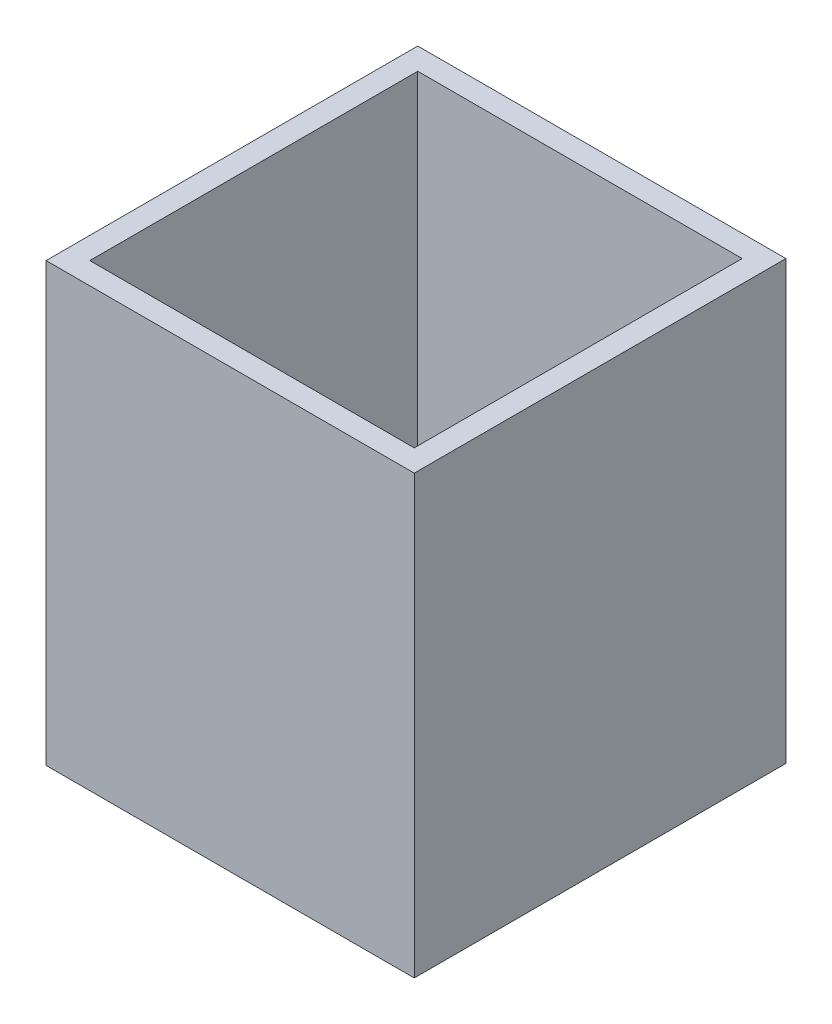
ISO-10303-21;
HEADER;
FILE_DESCRIPTION(('STEP AP214'),'2;1');
FILE_NAME('part.step','',(''),(''),'','','');
FILE_SCHEMA(('AUTOMOTIVE_DESIGN { 1 0 10303 214 1 1 1 1 }'));
ENDSEC;
DATA;
#1=APPLICATION_CONTEXT('core data for automotive mechanical design processes');
#2=APPLICATION_PROTOCOL_DEFINITION('international standard','automotive_design',2000,#1);
#3=PRODUCT_CONTEXT('',#1,'mechanical');
#4=PRODUCT('Part','Part','',(#3));
#5=PRODUCT_RELATED_PRODUCT_CATEGORY('part','',(#4));
#6=PRODUCT_DEFINITION_FORMATION('','',#4);
#7=PRODUCT_DEFINITION_CONTEXT('part definition',#1,'design');
#8=PRODUCT_DEFINITION('design','',#6,#7);
#9=PRODUCT_DEFINITION_SHAPE('','',#8);
#10=(LENGTH_UNIT() NAMED_UNIT(*) SI_UNIT(.MILLI.,.METRE.));
#11=(NAMED_UNIT(*) PLANE_ANGLE_UNIT() SI_UNIT($,.RADIAN.));
#12=(NAMED_UNIT(*) SI_UNIT($,.STERADIAN.) SOLID_ANGLE_UNIT());
#13=UNCERTAINTY_MEASURE_WITH_UNIT(LENGTH_MEASURE(1.E-05),#10,'distance_accuracy_value','');
#14=(GEOMETRIC_REPRESENTATION_CONTEXT(3) GLOBAL_UNCERTAINTY_ASSIGNED_CONTEXT((#13)) GLOBAL_UNIT_ASSIGNED_CONTEXT((#10,
#11,#12)) REPRESENTATION_CONTEXT('',''));
#15=CARTESIAN_POINT('',(0.,0.,0.));
#16=DIRECTION('',(0.,0.,1.));
#17=DIRECTION('',(1.,0.,0.));
#18=AXIS2_PLACEMENT_3D('',#15,#16,#17);
#19=CARTESIAN_POINT('',(0.,127.,0.));
#20=DIRECTION('',(0.,-1.,0.));
#21=DIRECTION('',(0.,0.,-1.));
#22=AXIS2_PLACEMENT_3D('',#19,#20,#21);
#23=PLANE('',#22);
#24=DIRECTION('',(0.,0.,-1.));
#25=VECTOR('',#24,1.);
#26=CARTESIAN_POINT('',(53.467,127.,53.975));
#27=LINE('',#26,#25);
#28=CARTESIAN_POINT('',(53.467,127.,53.975));
#29=VERTEX_POINT('',#28);
#30=CARTESIAN_POINT('',(53.467,127.,-53.975));
#31=VERTEX_POINT('',#30);
#32=EDGE_CURVE('E130',#29,#31,#27,.T.);
#33=ORIENTED_EDGE('',*,*,#32,.T.);
#34=DIRECTION('',(-1.,0.,0.));
#35=VECTOR('',#34,1.);
#36=CARTESIAN_POINT('',(-53.467,127.,-53.975));
#37=LINE('',#36,#35);
#38=CARTESIAN_POINT('',(-53.467,127.,-53.975));
#39=VERTEX_POINT('',#38);
#40=EDGE_CURVE('E133',#31,#39,#37,.T.);
#41=ORIENTED_EDGE('',*,*,#40,.T.);
#42=DIRECTION('',(0.,0.,1.));
#43=VECTOR('',#42,1.);
#44=CARTESIAN_POINT('',(-53.467,127.,53.975));
#45=LINE('',#44,#43);
#46=CARTESIAN_POINT('',(-53.467,127.,53.975));
#47=VERTEX_POINT('',#46);
#48=EDGE_CURVE('E136',#39,#47,#45,.T.);
#49=ORIENTED_EDGE('',*,*,#48,.T.);
#50=DIRECTION('',(1.,0.,0.));
#51=VECTOR('',#50,1.);
#52=CARTESIAN_POINT('',(-53.467,127.,53.975));
#53=LINE('',#52,#51);
#54=EDGE_CURVE('E138',#47,#29,#53,.T.);
#55=ORIENTED_EDGE('',*,*,#54,.T.);
#56=EDGE_LOOP('',(#33,#41,#49,#55));
#57=FACE_BOUND('',#56,.T.);
#58=DIRECTION('',(0.,0.,-1.));
#59=VECTOR('',#58,1.);
#60=CARTESIAN_POINT('',(47.117,127.,0.));
#61=LINE('',#60,#59);
#62=CARTESIAN_POINT('',(47.117,127.,47.625));
#63=VERTEX_POINT('',#62);
#64=CARTESIAN_POINT('',(47.117,127.,-47.625));
#65=VERTEX_POINT('',#64);
#66=EDGE_CURVE('E118',#63,#65,#61,.T.);
#67=ORIENTED_EDGE('',*,*,#66,.F.);
#68=DIRECTION('',(1.,0.,0.));
#69=VECTOR('',#68,1.);
#70=CARTESIAN_POINT('',(0.,127.,47.625));
#71=LINE('',#70,#69);
#72=CARTESIAN_POINT('',(-47.117,127.,47.625));
#73=VERTEX_POINT('',#72);
#74=EDGE_CURVE('E103',#73,#63,#71,.T.);
#75=ORIENTED_EDGE('',*,*,#74,.F.);
#76=DIRECTION('',(0.,0.,1.));
#77=VECTOR('',#76,1.);
#78=CARTESIAN_POINT('',(-47.117,127.,0.));
#79=LINE('',#78,#77);
#80=CARTESIAN_POINT('',(-47.117,127.,-47.625));
#81=VERTEX_POINT('',#80);
#82=EDGE_CURVE('E127',#81,#73,#79,.T.);
#83=ORIENTED_EDGE('',*,*,#82,.F.);
#84=DIRECTION('',(-1.,0.,0.));
#85=VECTOR('',#84,1.);
#86=CARTESIAN_POINT('',(0.,127.,-47.625));
#87=LINE('',#86,#85);
#88=EDGE_CURVE('E120',#65,#81,#87,.T.);
#89=ORIENTED_EDGE('',*,*,#88,.F.);
#90=EDGE_LOOP('',(#67,#75,#83,#89));
#91=FACE_BOUND('',#90,.T.);
#92=ADVANCED_FACE('F33',(#57,#91),#23,.F.);
#93=CARTESIAN_POINT('',(0.,0.,0.));
#94=DIRECTION('',(0.,-1.,0.));
#95=DIRECTION('',(0.,0.,-1.));
#96=AXIS2_PLACEMENT_3D('',#93,#94,#95);
#97=PLANE('',#96);
#98=DIRECTION('',(0.,0.,-1.));
#99=VECTOR('',#98,1.);
#100=CARTESIAN_POINT('',(53.467,0.,53.975));
#101=LINE('',#100,#99);
#102=CARTESIAN_POINT('',(53.467,0.,53.975));
#103=VERTEX_POINT('',#102);
#104=CARTESIAN_POINT('',(53.467,0.,-53.975));
#105=VERTEX_POINT('',#104);
#106=EDGE_CURVE('E141',#103,#105,#101,.T.);
#107=ORIENTED_EDGE('',*,*,#106,.F.);
#108=DIRECTION('',(1.,0.,0.));
#109=VECTOR('',#108,1.);
#110=CARTESIAN_POINT('',(-53.467,0.,53.975));
#111=LINE('',#110,#109);
#112=CARTESIAN_POINT('',(-53.467,0.,53.975));
#113=VERTEX_POINT('',#112);
#114=EDGE_CURVE('E134',#113,#103,#111,.T.);
#115=ORIENTED_EDGE('',*,*,#114,.F.);
#116=DIRECTION('',(0.,0.,1.));
#117=VECTOR('',#116,1.);
#118=CARTESIAN_POINT('',(-53.467,0.,53.975));
#119=LINE('',#118,#117);
#120=CARTESIAN_POINT('',(-53.467,0.,-53.975));
#121=VERTEX_POINT('',#120);
#122=EDGE_CURVE('E146',#121,#113,#119,.T.);
#123=ORIENTED_EDGE('',*,*,#122,.F.);
#124=DIRECTION('',(-1.,0.,0.));
#125=VECTOR('',#124,1.);
#126=CARTESIAN_POINT('',(-53.467,0.,-53.975));
#127=LINE('',#126,#125);
#128=EDGE_CURVE('E144',#105,#121,#127,.T.);
#129=ORIENTED_EDGE('',*,*,#128,.F.);
#130=EDGE_LOOP('',(#107,#115,#123,#129));
#131=FACE_BOUND('',#130,.T.);
#132=DIRECTION('',(1.,0.,0.));
#133=VECTOR('',#132,1.);
#134=CARTESIAN_POINT('',(0.,0.,47.625));
#135=LINE('',#134,#133);
#136=CARTESIAN_POINT('',(-47.117,0.,47.625));
#137=VERTEX_POINT('',#136);
#138=CARTESIAN_POINT('',(47.117,0.,47.625));
#139=VERTEX_POINT('',#138);
#140=EDGE_CURVE('E101',#137,#139,#135,.T.);
#141=ORIENTED_EDGE('',*,*,#140,.T.);
#142=DIRECTION('',(0.,0.,-1.));
#143=VECTOR('',#142,1.);
#144=CARTESIAN_POINT('',(47.117,0.,0.));
#145=LINE('',#144,#143);
#146=CARTESIAN_POINT('',(47.117,0.,-47.625));
#147=VERTEX_POINT('',#146);
#148=EDGE_CURVE('E109',#139,#147,#145,.T.);
#149=ORIENTED_EDGE('',*,*,#148,.T.);
#150=DIRECTION('',(-1.,0.,0.));
#151=VECTOR('',#150,1.);
#152=CARTESIAN_POINT('',(0.,0.,-47.625));
#153=LINE('',#152,#151);
#154=CARTESIAN_POINT('',(-47.117,0.,-47.625));
#155=VERTEX_POINT('',#154);
#156=EDGE_CURVE('E115',#147,#155,#153,.T.);
#157=ORIENTED_EDGE('',*,*,#156,.T.);
#158=DIRECTION('',(0.,0.,1.));
#159=VECTOR('',#158,1.);
#160=CARTESIAN_POINT('',(-47.117,0.,0.));
#161=LINE('',#160,#159);
#162=EDGE_CURVE('E55',#155,#137,#161,.T.);
#163=ORIENTED_EDGE('',*,*,#162,.T.);
#164=EDGE_LOOP('',(#141,#149,#157,#163));
#165=FACE_BOUND('',#164,.T.);
#166=ADVANCED_FACE('F117',(#131,#165),#97,.T.);
#167=CARTESIAN_POINT('',(53.467,127.,53.975));
#168=DIRECTION('',(-1.,0.,0.));
#169=DIRECTION('',(0.,0.,1.));
#170=AXIS2_PLACEMENT_3D('',#167,#168,#169);
#171=PLANE('',#170);
#172=ORIENTED_EDGE('',*,*,#106,.T.);
#173=DIRECTION('',(0.,-1.,0.));
#174=VECTOR('',#173,1.);
#175=CARTESIAN_POINT('',(53.467,127.,-53.975));
#176=LINE('',#175,#174);
#177=EDGE_CURVE('E11',#31,#105,#176,.T.);
#178=ORIENTED_EDGE('',*,*,#177,.F.);
#179=ORIENTED_EDGE('',*,*,#32,.F.);
#180=DIRECTION('',(0.,-1.,0.));
#181=VECTOR('',#180,1.);
#182=CARTESIAN_POINT('',(53.467,127.,53.975));
#183=LINE('',#182,#181);
#184=EDGE_CURVE('E140',#29,#103,#183,.T.);
#185=ORIENTED_EDGE('',*,*,#184,.T.);
#186=EDGE_LOOP('',(#172,#178,#179,#185));
#187=FACE_BOUND('',#186,.T.);
#188=ADVANCED_FACE('F35',(#187),#171,.F.);
#189=CARTESIAN_POINT('',(-53.467,127.,-53.975));
#190=DIRECTION('',(0.,0.,1.));
#191=DIRECTION('',(1.,0.,0.));
#192=AXIS2_PLACEMENT_3D('',#189,#190,#191);
#193=PLANE('',#192);
#194=ORIENTED_EDGE('',*,*,#128,.T.);
#195=DIRECTION('',(0.,-1.,0.));
#196=VECTOR('',#195,1.);
#197=CARTESIAN_POINT('',(-53.467,127.,-53.975));
#198=LINE('',#197,#196);
#199=EDGE_CURVE('E41',#39,#121,#198,.T.);
#200=ORIENTED_EDGE('',*,*,#199,.F.);
#201=ORIENTED_EDGE('',*,*,#40,.F.);
#202=ORIENTED_EDGE('',*,*,#177,.T.);
#203=EDGE_LOOP('',(#194,#200,#201,#202));
#204=FACE_BOUND('',#203,.T.);
#205=ADVANCED_FACE('F173',(#204),#193,.F.);
#206=CARTESIAN_POINT('',(-53.467,127.,53.975));
#207=DIRECTION('',(1.,0.,0.));
#208=DIRECTION('',(0.,0.,-1.));
#209=AXIS2_PLACEMENT_3D('',#206,#207,#208);
#210=PLANE('',#209);
#211=ORIENTED_EDGE('',*,*,#122,.T.);
#212=DIRECTION('',(0.,-1.,0.));
#213=VECTOR('',#212,1.);
#214=CARTESIAN_POINT('',(-53.467,127.,53.975));
#215=LINE('',#214,#213);
#216=EDGE_CURVE('E151',#47,#113,#215,.T.);
#217=ORIENTED_EDGE('',*,*,#216,.F.);
#218=ORIENTED_EDGE('',*,*,#48,.F.);
#219=ORIENTED_EDGE('',*,*,#199,.T.);
#220=EDGE_LOOP('',(#211,#217,#218,#219));
#221=FACE_BOUND('',#220,.T.);
#222=ADVANCED_FACE('F158',(#221),#210,.F.);
#223=CARTESIAN_POINT('',(-53.467,127.,53.975));
#224=DIRECTION('',(0.,0.,-1.));
#225=DIRECTION('',(-1.,0.,0.));
#226=AXIS2_PLACEMENT_3D('',#223,#224,#225);
#227=PLANE('',#226);
#228=ORIENTED_EDGE('',*,*,#114,.T.);
#229=ORIENTED_EDGE('',*,*,#184,.F.);
#230=ORIENTED_EDGE('',*,*,#54,.F.);
#231=ORIENTED_EDGE('',*,*,#216,.T.);
#232=EDGE_LOOP('',(#228,#229,#230,#231));
#233=FACE_BOUND('',#232,.T.);
#234=ADVANCED_FACE('F166',(#233),#227,.F.);
#235=CARTESIAN_POINT('',(47.117,127.,53.975));
#236=DIRECTION('',(-1.,0.,0.));
#237=DIRECTION('',(0.,0.,1.));
#238=AXIS2_PLACEMENT_3D('',#235,#236,#237);
#239=PLANE('',#238);
#240=ORIENTED_EDGE('',*,*,#148,.F.);
#241=DIRECTION('',(0.,-1.,0.));
#242=VECTOR('',#241,1.);
#243=CARTESIAN_POINT('',(47.117,127.,47.625));
#244=LINE('',#243,#242);
#245=EDGE_CURVE('E97',#63,#139,#244,.T.);
#246=ORIENTED_EDGE('',*,*,#245,.F.);
#247=ORIENTED_EDGE('',*,*,#66,.T.);
#248=DIRECTION('',(0.,-1.,0.));
#249=VECTOR('',#248,1.);
#250=CARTESIAN_POINT('',(47.117,127.,-47.625));
#251=LINE('',#250,#249);
#252=EDGE_CURVE('E112',#65,#147,#251,.T.);
#253=ORIENTED_EDGE('',*,*,#252,.T.);
#254=EDGE_LOOP('',(#240,#246,#247,#253));
#255=FACE_BOUND('',#254,.T.);
#256=ADVANCED_FACE('F110',(#255),#239,.T.);
#257=CARTESIAN_POINT('',(-53.467,127.,-47.625));
#258=DIRECTION('',(0.,0.,1.));
#259=DIRECTION('',(1.,0.,0.));
#260=AXIS2_PLACEMENT_3D('',#257,#258,#259);
#261=PLANE('',#260);
#262=ORIENTED_EDGE('',*,*,#156,.F.);
#263=ORIENTED_EDGE('',*,*,#252,.F.);
#264=ORIENTED_EDGE('',*,*,#88,.T.);
#265=DIRECTION('',(0.,-1.,0.));
#266=VECTOR('',#265,1.);
#267=CARTESIAN_POINT('',(-47.117,127.,-47.625));
#268=LINE('',#267,#266);
#269=EDGE_CURVE('E256',#81,#155,#268,.T.);
#270=ORIENTED_EDGE('',*,*,#269,.T.);
#271=EDGE_LOOP('',(#262,#263,#264,#270));
#272=FACE_BOUND('',#271,.T.);
#273=ADVANCED_FACE('F193',(#272),#261,.T.);
#274=CARTESIAN_POINT('',(-47.117,127.,53.975));
#275=DIRECTION('',(1.,0.,0.));
#276=DIRECTION('',(0.,0.,-1.));
#277=AXIS2_PLACEMENT_3D('',#274,#275,#276);
#278=PLANE('',#277);
#279=ORIENTED_EDGE('',*,*,#162,.F.);
#280=ORIENTED_EDGE('',*,*,#269,.F.);
#281=ORIENTED_EDGE('',*,*,#82,.T.);
#282=DIRECTION('',(0.,-1.,0.));
#283=VECTOR('',#282,1.);
#284=CARTESIAN_POINT('',(-47.117,127.,47.625));
#285=LINE('',#284,#283);
#286=EDGE_CURVE('E48',#73,#137,#285,.T.);
#287=ORIENTED_EDGE('',*,*,#286,.T.);
#288=EDGE_LOOP('',(#279,#280,#281,#287));
#289=FACE_BOUND('',#288,.T.);
#290=ADVANCED_FACE('F198',(#289),#278,.T.);
#291=CARTESIAN_POINT('',(-53.467,127.,47.625));
#292=DIRECTION('',(0.,0.,-1.));
#293=DIRECTION('',(-1.,0.,0.));
#294=AXIS2_PLACEMENT_3D('',#291,#292,#293);
#295=PLANE('',#294);
#296=ORIENTED_EDGE('',*,*,#140,.F.);
#297=ORIENTED_EDGE('',*,*,#286,.F.);
#298=ORIENTED_EDGE('',*,*,#74,.T.);
#299=ORIENTED_EDGE('',*,*,#245,.T.);
#300=EDGE_LOOP('',(#296,#297,#298,#299));
#301=FACE_BOUND('',#300,.T.);
#302=ADVANCED_FACE('F99',(#301),#295,.T.);
#303=CLOSED_SHELL('',(#92,#166,#188,#205,#222,#234,#256,#273,#290,#302));
#304=MANIFOLD_SOLID_BREP('B2',#303);
#305=ADVANCED_BREP_SHAPE_REPRESENTATION('',(#18,#304),#14);
#306=SHAPE_DEFINITION_REPRESENTATION(#9,#305);
ENDSEC;
END-ISO-10303-21;
